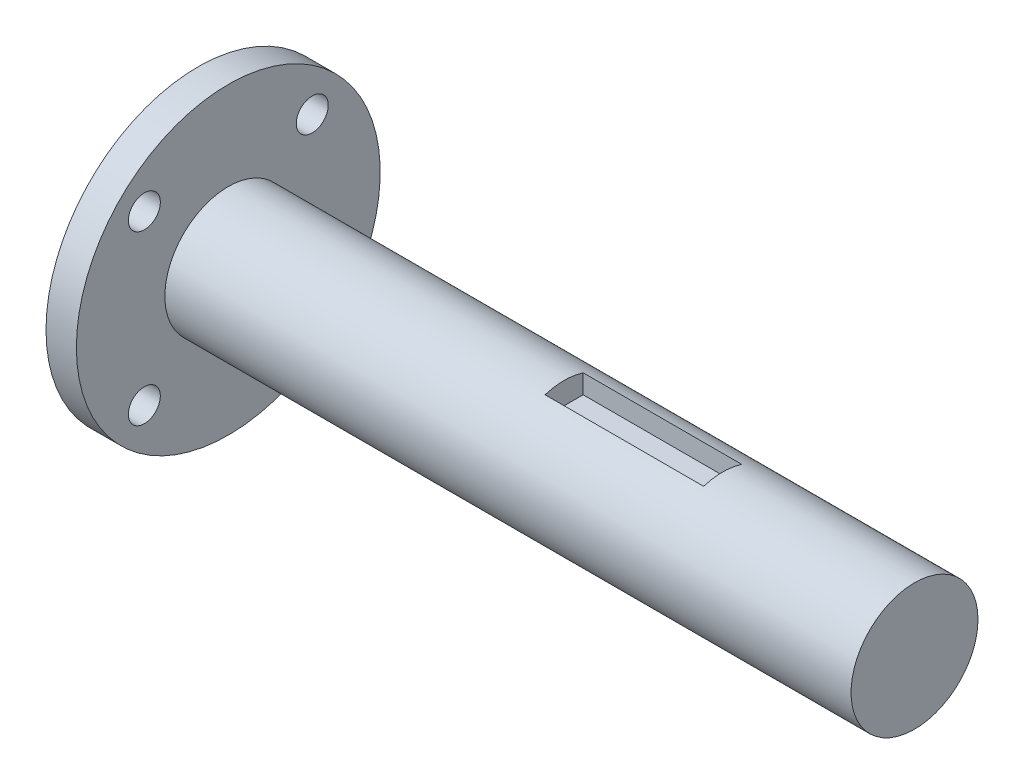
ISO-10303-21;
HEADER;
FILE_DESCRIPTION(('STEP AP214'),'2;1');
FILE_NAME('part.step','',(''),(''),'','','');
FILE_SCHEMA(('AUTOMOTIVE_DESIGN { 1 0 10303 214 1 1 1 1 }'));
ENDSEC;
DATA;
#1=APPLICATION_CONTEXT('core data for automotive mechanical design processes');
#2=APPLICATION_PROTOCOL_DEFINITION('international standard','automotive_design',2000,#1);
#3=PRODUCT_CONTEXT('',#1,'mechanical');
#4=PRODUCT('Part','Part','',(#3));
#5=PRODUCT_RELATED_PRODUCT_CATEGORY('part','',(#4));
#6=PRODUCT_DEFINITION_FORMATION('','',#4);
#7=PRODUCT_DEFINITION_CONTEXT('part definition',#1,'design');
#8=PRODUCT_DEFINITION('design','',#6,#7);
#9=PRODUCT_DEFINITION_SHAPE('','',#8);
#10=(LENGTH_UNIT() NAMED_UNIT(*) SI_UNIT(.MILLI.,.METRE.));
#11=(NAMED_UNIT(*) PLANE_ANGLE_UNIT() SI_UNIT($,.RADIAN.));
#12=(NAMED_UNIT(*) SI_UNIT($,.STERADIAN.) SOLID_ANGLE_UNIT());
#13=UNCERTAINTY_MEASURE_WITH_UNIT(LENGTH_MEASURE(1.E-05),#10,'distance_accuracy_value','');
#14=(GEOMETRIC_REPRESENTATION_CONTEXT(3) GLOBAL_UNCERTAINTY_ASSIGNED_CONTEXT((#13)) GLOBAL_UNIT_ASSIGNED_CONTEXT((#10,
#11,#12)) REPRESENTATION_CONTEXT('',''));
#15=CARTESIAN_POINT('',(0.,0.,0.));
#16=DIRECTION('',(0.,0.,1.));
#17=DIRECTION('',(1.,0.,0.));
#18=AXIS2_PLACEMENT_3D('',#15,#16,#17);
#19=CARTESIAN_POINT('',(42.,0.,0.));
#20=DIRECTION('',(-1.,0.,0.));
#21=DIRECTION('',(0.,0.,1.));
#22=AXIS2_PLACEMENT_3D('',#19,#20,#21);
#23=CYLINDRICAL_SURFACE('',#22,7.9375);
#24=CARTESIAN_POINT('',(42.,0.,0.));
#25=DIRECTION('',(1.,0.,0.));
#26=DIRECTION('',(0.,0.,-1.));
#27=AXIS2_PLACEMENT_3D('',#24,#25,#26);
#28=CIRCLE('',#27,7.9375);
#29=CARTESIAN_POINT('',(42.,7.57181378534892,-2.3815));
#30=VERTEX_POINT('',#29);
#31=CARTESIAN_POINT('',(42.,7.57181378534892,2.3815));
#32=VERTEX_POINT('',#31);
#33=EDGE_CURVE('E11',#30,#32,#28,.T.);
#34=ORIENTED_EDGE('',*,*,#33,.F.);
#35=DIRECTION('',(-1.,0.,0.));
#36=VECTOR('',#35,1.);
#37=CARTESIAN_POINT('',(61.8272,7.57181378534892,-2.3815));
#38=LINE('',#37,#36);
#39=CARTESIAN_POINT('',(61.8272,7.57181378534892,-2.3815));
#40=VERTEX_POINT('',#39);
#41=EDGE_CURVE('E102',#40,#30,#38,.T.);
#42=ORIENTED_EDGE('',*,*,#41,.F.);
#43=CARTESIAN_POINT('',(61.8272,0.,0.));
#44=DIRECTION('',(1.,0.,0.));
#45=DIRECTION('',(0.,0.,-1.));
#46=AXIS2_PLACEMENT_3D('',#43,#44,#45);
#47=CIRCLE('',#46,7.9375);
#48=CARTESIAN_POINT('',(61.8272,7.57181378534892,2.3815));
#49=VERTEX_POINT('',#48);
#50=EDGE_CURVE('E180',#40,#49,#47,.T.);
#51=ORIENTED_EDGE('',*,*,#50,.T.);
#52=DIRECTION('',(-1.,0.,0.));
#53=VECTOR('',#52,1.);
#54=CARTESIAN_POINT('',(61.8272,7.57181378534892,2.3815));
#55=LINE('',#54,#53);
#56=EDGE_CURVE('E74',#49,#32,#55,.T.);
#57=ORIENTED_EDGE('',*,*,#56,.T.);
#58=EDGE_LOOP('',(#34,#42,#51,#57));
#59=FACE_BOUND('',#58,.T.);
#60=CARTESIAN_POINT('',(0.,0.,0.));
#61=DIRECTION('',(1.,0.,0.));
#62=DIRECTION('',(0.,0.,-1.));
#63=AXIS2_PLACEMENT_3D('',#60,#61,#62);
#64=CIRCLE('',#63,7.9375);
#65=CARTESIAN_POINT('',(0.,0.,-7.9375));
#66=VERTEX_POINT('',#65);
#67=EDGE_CURVE('E36',#66,#66,#64,.T.);
#68=ORIENTED_EDGE('',*,*,#67,.T.);
#69=EDGE_LOOP('',(#68));
#70=FACE_BOUND('',#69,.T.);
#71=CARTESIAN_POINT('',(85.8272,0.,0.));
#72=DIRECTION('',(1.,0.,0.));
#73=DIRECTION('',(0.,0.,-1.));
#74=AXIS2_PLACEMENT_3D('',#71,#72,#73);
#75=CIRCLE('',#74,7.9375);
#76=CARTESIAN_POINT('',(85.8272,0.,-7.9375));
#77=VERTEX_POINT('',#76);
#78=EDGE_CURVE('E97',#77,#77,#75,.T.);
#79=ORIENTED_EDGE('',*,*,#78,.F.);
#80=EDGE_LOOP('',(#79));
#81=FACE_BOUND('',#80,.T.);
#82=ADVANCED_FACE('F33',(#59,#70,#81),#23,.T.);
#83=CARTESIAN_POINT('',(42.,0.,0.));
#84=DIRECTION('',(1.,0.,0.));
#85=DIRECTION('',(0.,0.,-1.));
#86=AXIS2_PLACEMENT_3D('',#83,#84,#85);
#87=PLANE('',#86);
#88=DIRECTION('',(0.,1.,0.));
#89=VECTOR('',#88,1.);
#90=CARTESIAN_POINT('',(42.,5.18881378534892,2.3815));
#91=LINE('',#90,#89);
#92=CARTESIAN_POINT('',(42.,5.18881378534892,2.3815));
#93=VERTEX_POINT('',#92);
#94=EDGE_CURVE('E46',#93,#32,#91,.T.);
#95=ORIENTED_EDGE('',*,*,#94,.F.);
#96=DIRECTION('',(0.,0.,1.));
#97=VECTOR('',#96,1.);
#98=CARTESIAN_POINT('',(42.,5.18881378534892,2.3815));
#99=LINE('',#98,#97);
#100=CARTESIAN_POINT('',(42.,5.18881378534892,-2.3815));
#101=VERTEX_POINT('',#100);
#102=EDGE_CURVE('E80',#101,#93,#99,.T.);
#103=ORIENTED_EDGE('',*,*,#102,.F.);
#104=DIRECTION('',(0.,-1.,0.));
#105=VECTOR('',#104,1.);
#106=CARTESIAN_POINT('',(42.,5.18881378534892,-2.3815));
#107=LINE('',#106,#105);
#108=EDGE_CURVE('E96',#30,#101,#107,.T.);
#109=ORIENTED_EDGE('',*,*,#108,.F.);
#110=ORIENTED_EDGE('',*,*,#33,.T.);
#111=EDGE_LOOP('',(#95,#103,#109,#110));
#112=FACE_BOUND('',#111,.T.);
#113=ADVANCED_FACE('F168',(#112),#87,.T.);
#114=CARTESIAN_POINT('',(-3.8,0.,0.));
#115=DIRECTION('',(-1.,0.,0.));
#116=DIRECTION('',(0.,0.,1.));
#117=AXIS2_PLACEMENT_3D('',#114,#115,#116);
#118=PLANE('',#117);
#119=CARTESIAN_POINT('',(-3.8,-10.5,10.5));
#120=DIRECTION('',(-1.,0.,0.));
#121=DIRECTION('',(0.,0.,1.));
#122=AXIS2_PLACEMENT_3D('',#119,#120,#121);
#123=CIRCLE('',#122,2.);
#124=CARTESIAN_POINT('',(-3.8,-10.5,12.5));
#125=VERTEX_POINT('',#124);
#126=EDGE_CURVE('E113',#125,#125,#123,.T.);
#127=ORIENTED_EDGE('',*,*,#126,.F.);
#128=EDGE_LOOP('',(#127));
#129=FACE_BOUND('',#128,.T.);
#130=CARTESIAN_POINT('',(-3.8,10.5,-10.5));
#131=DIRECTION('',(-1.,0.,0.));
#132=DIRECTION('',(0.,0.,1.));
#133=AXIS2_PLACEMENT_3D('',#130,#131,#132);
#134=CIRCLE('',#133,2.);
#135=CARTESIAN_POINT('',(-3.8,10.5,-8.5));
#136=VERTEX_POINT('',#135);
#137=EDGE_CURVE('E125',#136,#136,#134,.T.);
#138=ORIENTED_EDGE('',*,*,#137,.F.);
#139=EDGE_LOOP('',(#138));
#140=FACE_BOUND('',#139,.T.);
#141=CARTESIAN_POINT('',(-3.8,0.,0.));
#142=DIRECTION('',(-1.,0.,0.));
#143=DIRECTION('',(0.,0.,1.));
#144=AXIS2_PLACEMENT_3D('',#141,#142,#143);
#145=CIRCLE('',#144,19.);
#146=CARTESIAN_POINT('',(-3.8,0.,19.));
#147=VERTEX_POINT('',#146);
#148=EDGE_CURVE('E131',#147,#147,#145,.T.);
#149=ORIENTED_EDGE('',*,*,#148,.T.);
#150=EDGE_LOOP('',(#149));
#151=FACE_BOUND('',#150,.T.);
#152=CARTESIAN_POINT('',(-3.8,10.5,10.5));
#153=DIRECTION('',(-1.,0.,0.));
#154=DIRECTION('',(0.,0.,-1.));
#155=AXIS2_PLACEMENT_3D('',#152,#153,#154);
#156=CIRCLE('',#155,2.);
#157=CARTESIAN_POINT('',(-3.8,10.5,8.5));
#158=VERTEX_POINT('',#157);
#159=EDGE_CURVE('E119',#158,#158,#156,.T.);
#160=ORIENTED_EDGE('',*,*,#159,.F.);
#161=EDGE_LOOP('',(#160));
#162=FACE_BOUND('',#161,.T.);
#163=CARTESIAN_POINT('',(-3.8,-10.5,-10.5));
#164=DIRECTION('',(-1.,0.,0.));
#165=DIRECTION('',(0.,0.,-1.));
#166=AXIS2_PLACEMENT_3D('',#163,#164,#165);
#167=CIRCLE('',#166,2.);
#168=CARTESIAN_POINT('',(-3.8,-10.5,-12.5));
#169=VERTEX_POINT('',#168);
#170=EDGE_CURVE('E107',#169,#169,#167,.T.);
#171=ORIENTED_EDGE('',*,*,#170,.F.);
#172=EDGE_LOOP('',(#171));
#173=FACE_BOUND('',#172,.T.);
#174=ADVANCED_FACE('F142',(#129,#140,#151,#162,#173),#118,.T.);
#175=CARTESIAN_POINT('',(0.,0.,0.));
#176=DIRECTION('',(-1.,0.,0.));
#177=DIRECTION('',(0.,0.,1.));
#178=AXIS2_PLACEMENT_3D('',#175,#176,#177);
#179=PLANE('',#178);
#180=ORIENTED_EDGE('',*,*,#67,.F.);
#181=EDGE_LOOP('',(#180));
#182=FACE_BOUND('',#181,.T.);
#183=CARTESIAN_POINT('',(0.,0.,0.));
#184=DIRECTION('',(-1.,0.,0.));
#185=DIRECTION('',(0.,0.,1.));
#186=AXIS2_PLACEMENT_3D('',#183,#184,#185);
#187=CIRCLE('',#186,19.);
#188=CARTESIAN_POINT('',(0.,0.,19.));
#189=VERTEX_POINT('',#188);
#190=EDGE_CURVE('E128',#189,#189,#187,.T.);
#191=ORIENTED_EDGE('',*,*,#190,.F.);
#192=EDGE_LOOP('',(#191));
#193=FACE_BOUND('',#192,.T.);
#194=CARTESIAN_POINT('',(0.,10.5,-10.5));
#195=DIRECTION('',(-1.,0.,0.));
#196=DIRECTION('',(0.,0.,1.));
#197=AXIS2_PLACEMENT_3D('',#194,#195,#196);
#198=CIRCLE('',#197,2.);
#199=CARTESIAN_POINT('',(0.,10.5,-8.5));
#200=VERTEX_POINT('',#199);
#201=EDGE_CURVE('E122',#200,#200,#198,.T.);
#202=ORIENTED_EDGE('',*,*,#201,.T.);
#203=EDGE_LOOP('',(#202));
#204=FACE_BOUND('',#203,.T.);
#205=CARTESIAN_POINT('',(0.,10.5,10.5));
#206=DIRECTION('',(-1.,0.,0.));
#207=DIRECTION('',(0.,0.,-1.));
#208=AXIS2_PLACEMENT_3D('',#205,#206,#207);
#209=CIRCLE('',#208,2.);
#210=CARTESIAN_POINT('',(0.,10.5,8.5));
#211=VERTEX_POINT('',#210);
#212=EDGE_CURVE('E116',#211,#211,#209,.T.);
#213=ORIENTED_EDGE('',*,*,#212,.T.);
#214=EDGE_LOOP('',(#213));
#215=FACE_BOUND('',#214,.T.);
#216=CARTESIAN_POINT('',(0.,-10.5,10.5));
#217=DIRECTION('',(-1.,0.,0.));
#218=DIRECTION('',(0.,0.,1.));
#219=AXIS2_PLACEMENT_3D('',#216,#217,#218);
#220=CIRCLE('',#219,2.);
#221=CARTESIAN_POINT('',(0.,-10.5,12.5));
#222=VERTEX_POINT('',#221);
#223=EDGE_CURVE('E110',#222,#222,#220,.T.);
#224=ORIENTED_EDGE('',*,*,#223,.T.);
#225=EDGE_LOOP('',(#224));
#226=FACE_BOUND('',#225,.T.);
#227=CARTESIAN_POINT('',(0.,-10.5,-10.5));
#228=DIRECTION('',(-1.,0.,0.));
#229=DIRECTION('',(0.,0.,-1.));
#230=AXIS2_PLACEMENT_3D('',#227,#228,#229);
#231=CIRCLE('',#230,2.);
#232=CARTESIAN_POINT('',(0.,-10.5,-12.5));
#233=VERTEX_POINT('',#232);
#234=EDGE_CURVE('E106',#233,#233,#231,.T.);
#235=ORIENTED_EDGE('',*,*,#234,.T.);
#236=EDGE_LOOP('',(#235));
#237=FACE_BOUND('',#236,.T.);
#238=ADVANCED_FACE('F139',(#182,#193,#204,#215,#226,#237),#179,.F.);
#239=CARTESIAN_POINT('',(-3.8,0.,0.));
#240=DIRECTION('',(1.,0.,0.));
#241=DIRECTION('',(0.,0.,-1.));
#242=AXIS2_PLACEMENT_3D('',#239,#240,#241);
#243=CYLINDRICAL_SURFACE('',#242,19.);
#244=ORIENTED_EDGE('',*,*,#148,.F.);
#245=EDGE_LOOP('',(#244));
#246=FACE_BOUND('',#245,.T.);
#247=ORIENTED_EDGE('',*,*,#190,.T.);
#248=EDGE_LOOP('',(#247));
#249=FACE_BOUND('',#248,.T.);
#250=ADVANCED_FACE('F137',(#246,#249),#243,.T.);
#251=CARTESIAN_POINT('',(-3.8,10.5,-10.5));
#252=DIRECTION('',(1.,0.,0.));
#253=DIRECTION('',(0.,0.,-1.));
#254=AXIS2_PLACEMENT_3D('',#251,#252,#253);
#255=CYLINDRICAL_SURFACE('',#254,2.);
#256=ORIENTED_EDGE('',*,*,#137,.T.);
#257=EDGE_LOOP('',(#256));
#258=FACE_BOUND('',#257,.T.);
#259=ORIENTED_EDGE('',*,*,#201,.F.);
#260=EDGE_LOOP('',(#259));
#261=FACE_BOUND('',#260,.T.);
#262=ADVANCED_FACE('F248',(#258,#261),#255,.F.);
#263=CARTESIAN_POINT('',(-3.8,10.5,10.5));
#264=DIRECTION('',(1.,0.,0.));
#265=DIRECTION('',(0.,0.,-1.));
#266=AXIS2_PLACEMENT_3D('',#263,#264,#265);
#267=CYLINDRICAL_SURFACE('',#266,2.);
#268=ORIENTED_EDGE('',*,*,#159,.T.);
#269=EDGE_LOOP('',(#268));
#270=FACE_BOUND('',#269,.T.);
#271=ORIENTED_EDGE('',*,*,#212,.F.);
#272=EDGE_LOOP('',(#271));
#273=FACE_BOUND('',#272,.T.);
#274=ADVANCED_FACE('F164',(#270,#273),#267,.F.);
#275=CARTESIAN_POINT('',(-3.8,-10.5,10.5));
#276=DIRECTION('',(1.,0.,0.));
#277=DIRECTION('',(0.,0.,-1.));
#278=AXIS2_PLACEMENT_3D('',#275,#276,#277);
#279=CYLINDRICAL_SURFACE('',#278,2.);
#280=ORIENTED_EDGE('',*,*,#126,.T.);
#281=EDGE_LOOP('',(#280));
#282=FACE_BOUND('',#281,.T.);
#283=ORIENTED_EDGE('',*,*,#223,.F.);
#284=EDGE_LOOP('',(#283));
#285=FACE_BOUND('',#284,.T.);
#286=ADVANCED_FACE('F155',(#282,#285),#279,.F.);
#287=CARTESIAN_POINT('',(-3.8,-10.5,-10.5));
#288=DIRECTION('',(1.,0.,0.));
#289=DIRECTION('',(0.,0.,-1.));
#290=AXIS2_PLACEMENT_3D('',#287,#288,#289);
#291=CYLINDRICAL_SURFACE('',#290,2.);
#292=ORIENTED_EDGE('',*,*,#170,.T.);
#293=EDGE_LOOP('',(#292));
#294=FACE_BOUND('',#293,.T.);
#295=ORIENTED_EDGE('',*,*,#234,.F.);
#296=EDGE_LOOP('',(#295));
#297=FACE_BOUND('',#296,.T.);
#298=ADVANCED_FACE('F153',(#294,#297),#291,.F.);
#299=CARTESIAN_POINT('',(61.8272,5.18881378534892,2.3815));
#300=DIRECTION('',(0.,0.,1.));
#301=DIRECTION('',(1.,0.,0.));
#302=AXIS2_PLACEMENT_3D('',#299,#300,#301);
#303=PLANE('',#302);
#304=ORIENTED_EDGE('',*,*,#94,.T.);
#305=ORIENTED_EDGE('',*,*,#56,.F.);
#306=DIRECTION('',(0.,1.,0.));
#307=VECTOR('',#306,1.);
#308=CARTESIAN_POINT('',(61.8272,5.18881378534892,2.3815));
#309=LINE('',#308,#307);
#310=CARTESIAN_POINT('',(61.8272,5.18881378534892,2.3815));
#311=VERTEX_POINT('',#310);
#312=EDGE_CURVE('E70',#311,#49,#309,.T.);
#313=ORIENTED_EDGE('',*,*,#312,.F.);
#314=DIRECTION('',(-1.,0.,0.));
#315=VECTOR('',#314,1.);
#316=CARTESIAN_POINT('',(61.8272,5.18881378534892,2.3815));
#317=LINE('',#316,#315);
#318=EDGE_CURVE('E73',#311,#93,#317,.T.);
#319=ORIENTED_EDGE('',*,*,#318,.T.);
#320=EDGE_LOOP('',(#304,#305,#313,#319));
#321=FACE_BOUND('',#320,.T.);
#322=ADVANCED_FACE('F72',(#321),#303,.F.);
#323=CARTESIAN_POINT('',(61.8272,5.18881378534892,-2.3815));
#324=DIRECTION('',(0.,0.,-1.));
#325=DIRECTION('',(-1.,0.,0.));
#326=AXIS2_PLACEMENT_3D('',#323,#324,#325);
#327=PLANE('',#326);
#328=ORIENTED_EDGE('',*,*,#108,.T.);
#329=DIRECTION('',(-1.,0.,0.));
#330=VECTOR('',#329,1.);
#331=CARTESIAN_POINT('',(61.8272,5.18881378534892,-2.3815));
#332=LINE('',#331,#330);
#333=CARTESIAN_POINT('',(61.8272,5.18881378534892,-2.3815));
#334=VERTEX_POINT('',#333);
#335=EDGE_CURVE('E88',#334,#101,#332,.T.);
#336=ORIENTED_EDGE('',*,*,#335,.F.);
#337=DIRECTION('',(0.,-1.,0.));
#338=VECTOR('',#337,1.);
#339=CARTESIAN_POINT('',(61.8272,5.18881378534892,-2.3815));
#340=LINE('',#339,#338);
#341=EDGE_CURVE('E79',#40,#334,#340,.T.);
#342=ORIENTED_EDGE('',*,*,#341,.F.);
#343=ORIENTED_EDGE('',*,*,#41,.T.);
#344=EDGE_LOOP('',(#328,#336,#342,#343));
#345=FACE_BOUND('',#344,.T.);
#346=ADVANCED_FACE('F162',(#345),#327,.F.);
#347=CARTESIAN_POINT('',(61.8272,5.18881378534892,2.3815));
#348=DIRECTION('',(0.,-1.,0.));
#349=DIRECTION('',(0.,0.,-1.));
#350=AXIS2_PLACEMENT_3D('',#347,#348,#349);
#351=PLANE('',#350);
#352=ORIENTED_EDGE('',*,*,#102,.T.);
#353=ORIENTED_EDGE('',*,*,#318,.F.);
#354=DIRECTION('',(0.,0.,1.));
#355=VECTOR('',#354,1.);
#356=CARTESIAN_POINT('',(61.8272,5.18881378534892,2.3815));
#357=LINE('',#356,#355);
#358=EDGE_CURVE('E86',#334,#311,#357,.T.);
#359=ORIENTED_EDGE('',*,*,#358,.F.);
#360=ORIENTED_EDGE('',*,*,#335,.T.);
#361=EDGE_LOOP('',(#352,#353,#359,#360));
#362=FACE_BOUND('',#361,.T.);
#363=ADVANCED_FACE('F84',(#362),#351,.F.);
#364=CARTESIAN_POINT('',(61.8272,0.,0.));
#365=DIRECTION('',(1.,0.,0.));
#366=DIRECTION('',(0.,0.,-1.));
#367=AXIS2_PLACEMENT_3D('',#364,#365,#366);
#368=PLANE('',#367);
#369=ORIENTED_EDGE('',*,*,#358,.T.);
#370=ORIENTED_EDGE('',*,*,#312,.T.);
#371=ORIENTED_EDGE('',*,*,#50,.F.);
#372=ORIENTED_EDGE('',*,*,#341,.T.);
#373=EDGE_LOOP('',(#369,#370,#371,#372));
#374=FACE_BOUND('',#373,.T.);
#375=ADVANCED_FACE('F90',(#374),#368,.F.);
#376=CARTESIAN_POINT('',(85.8272,0.,0.));
#377=DIRECTION('',(1.,0.,0.));
#378=DIRECTION('',(0.,0.,-1.));
#379=AXIS2_PLACEMENT_3D('',#376,#377,#378);
#380=PLANE('',#379);
#381=ORIENTED_EDGE('',*,*,#78,.T.);
#382=EDGE_LOOP('',(#381));
#383=FACE_BOUND('',#382,.T.);
#384=ADVANCED_FACE('F193',(#383),#380,.T.);
#385=CLOSED_SHELL('',(#82,#113,#174,#238,#250,#262,#274,#286,#298,#322,#346,#363,#375,#384));
#386=MANIFOLD_SOLID_BREP('B2',#385);
#387=ADVANCED_BREP_SHAPE_REPRESENTATION('',(#18,#386),#14);
#388=SHAPE_DEFINITION_REPRESENTATION(#9,#387);
ENDSEC;
END-ISO-10303-21;
